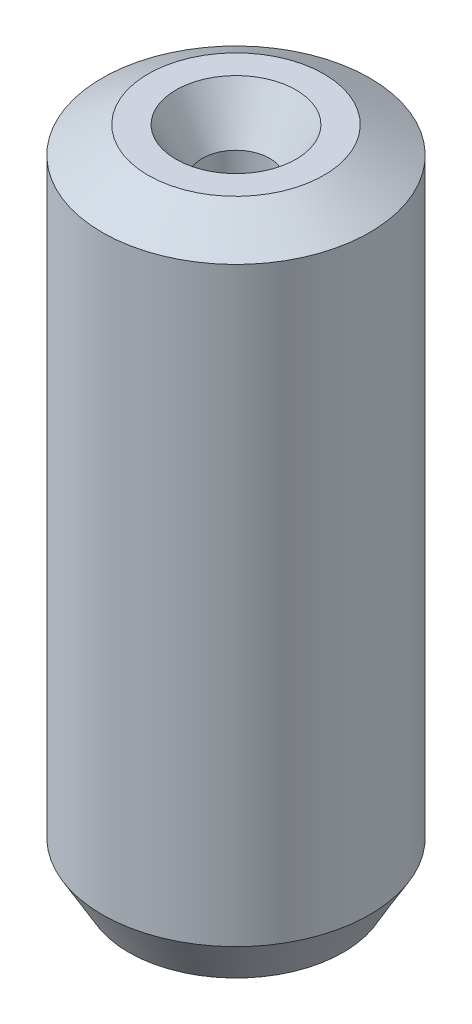
ISO-10303-21;
HEADER;
FILE_DESCRIPTION(('STEP AP214'),'2;1');
FILE_NAME('part.step','',(''),(''),'','','');
FILE_SCHEMA(('AUTOMOTIVE_DESIGN { 1 0 10303 214 1 1 1 1 }'));
ENDSEC;
DATA;
#1=APPLICATION_CONTEXT('core data for automotive mechanical design processes');
#2=APPLICATION_PROTOCOL_DEFINITION('international standard','automotive_design',2000,#1);
#3=PRODUCT_CONTEXT('',#1,'mechanical');
#4=PRODUCT('Part','Part','',(#3));
#5=PRODUCT_RELATED_PRODUCT_CATEGORY('part','',(#4));
#6=PRODUCT_DEFINITION_FORMATION('','',#4);
#7=PRODUCT_DEFINITION_CONTEXT('part definition',#1,'design');
#8=PRODUCT_DEFINITION('design','',#6,#7);
#9=PRODUCT_DEFINITION_SHAPE('','',#8);
#10=(LENGTH_UNIT() NAMED_UNIT(*) SI_UNIT(.MILLI.,.METRE.));
#11=(NAMED_UNIT(*) PLANE_ANGLE_UNIT() SI_UNIT($,.RADIAN.));
#12=(NAMED_UNIT(*) SI_UNIT($,.STERADIAN.) SOLID_ANGLE_UNIT());
#13=UNCERTAINTY_MEASURE_WITH_UNIT(LENGTH_MEASURE(1.E-05),#10,'distance_accuracy_value','');
#14=(GEOMETRIC_REPRESENTATION_CONTEXT(3) GLOBAL_UNCERTAINTY_ASSIGNED_CONTEXT((#13)) GLOBAL_UNIT_ASSIGNED_CONTEXT((#10,
#11,#12)) REPRESENTATION_CONTEXT('',''));
#15=CARTESIAN_POINT('',(0.,0.,0.));
#16=DIRECTION('',(0.,0.,1.));
#17=DIRECTION('',(1.,0.,0.));
#18=AXIS2_PLACEMENT_3D('',#15,#16,#17);
#19=CARTESIAN_POINT('',(0.,24.7867432425928,0.));
#20=DIRECTION('',(0.,-1.,0.));
#21=DIRECTION('',(0.,0.,-1.));
#22=AXIS2_PLACEMENT_3D('',#19,#20,#21);
#23=CYLINDRICAL_SURFACE('',#22,5.);
#24=CARTESIAN_POINT('',(0.,1.71622205691779,0.));
#25=DIRECTION('',(0.,1.,0.));
#26=DIRECTION('',(0.,0.,1.));
#27=AXIS2_PLACEMENT_3D('',#24,#25,#26);
#28=CIRCLE('',#27,5.);
#29=CARTESIAN_POINT('',(0.,1.71622205691779,5.));
#30=VERTEX_POINT('',#29);
#31=EDGE_CURVE('E10',#30,#30,#28,.T.);
#32=ORIENTED_EDGE('',*,*,#31,.T.);
#33=EDGE_LOOP('',(#32));
#34=FACE_BOUND('',#33,.T.);
#35=CARTESIAN_POINT('',(0.,23.7958819760422,0.));
#36=DIRECTION('',(0.,1.,0.));
#37=DIRECTION('',(0.,0.,1.));
#38=AXIS2_PLACEMENT_3D('',#35,#36,#37);
#39=CIRCLE('',#38,5.);
#40=CARTESIAN_POINT('',(0.,23.7958819760422,5.));
#41=VERTEX_POINT('',#40);
#42=EDGE_CURVE('E50',#41,#41,#39,.F.);
#43=ORIENTED_EDGE('',*,*,#42,.T.);
#44=EDGE_LOOP('',(#43));
#45=FACE_BOUND('',#44,.T.);
#46=ADVANCED_FACE('F39',(#34,#45),#23,.T.);
#47=CARTESIAN_POINT('',(0.,24.7867432425928,0.));
#48=DIRECTION('',(0.,1.,0.));
#49=DIRECTION('',(0.,0.,1.));
#50=AXIS2_PLACEMENT_3D('',#47,#48,#49);
#51=PLANE('',#50);
#52=CARTESIAN_POINT('',(0.,24.7867432425928,0.));
#53=DIRECTION('',(0.,1.,0.));
#54=DIRECTION('',(0.,0.,1.));
#55=AXIS2_PLACEMENT_3D('',#52,#53,#54);
#56=CIRCLE('',#55,2.24476600900823);
#57=CARTESIAN_POINT('',(0.,24.7867432425928,2.24476600900822));
#58=VERTEX_POINT('',#57);
#59=EDGE_CURVE('E58',#58,#58,#56,.F.);
#60=ORIENTED_EDGE('',*,*,#59,.T.);
#61=EDGE_LOOP('',(#60));
#62=FACE_BOUND('',#61,.T.);
#63=CARTESIAN_POINT('',(0.,24.7867432425928,0.));
#64=DIRECTION('',(0.,1.,0.));
#65=DIRECTION('',(0.,0.,1.));
#66=AXIS2_PLACEMENT_3D('',#63,#64,#65);
#67=CIRCLE('',#66,3.2837779430822);
#68=CARTESIAN_POINT('',(0.,24.7867432425928,3.2837779430822));
#69=VERTEX_POINT('',#68);
#70=EDGE_CURVE('E61',#69,#69,#67,.T.);
#71=ORIENTED_EDGE('',*,*,#70,.T.);
#72=EDGE_LOOP('',(#71));
#73=FACE_BOUND('',#72,.T.);
#74=ADVANCED_FACE('F88',(#62,#73),#51,.T.);
#75=CARTESIAN_POINT('',(0.,0.,0.));
#76=DIRECTION('',(0.,1.,0.));
#77=DIRECTION('',(0.,0.,1.));
#78=AXIS2_PLACEMENT_3D('',#75,#76,#77);
#79=PLANE('',#78);
#80=CARTESIAN_POINT('',(0.,0.,0.));
#81=DIRECTION('',(0.,1.,0.));
#82=DIRECTION('',(0.,0.,1.));
#83=AXIS2_PLACEMENT_3D('',#80,#81,#82);
#84=CIRCLE('',#83,2.97012679937535);
#85=CARTESIAN_POINT('',(0.,0.,2.97012679937535));
#86=VERTEX_POINT('',#85);
#87=EDGE_CURVE('E51',#86,#86,#84,.T.);
#88=ORIENTED_EDGE('',*,*,#87,.T.);
#89=EDGE_LOOP('',(#88));
#90=FACE_BOUND('',#89,.T.);
#91=CARTESIAN_POINT('',(0.,0.,0.));
#92=DIRECTION('',(0.,1.,0.));
#93=DIRECTION('',(0.,0.,1.));
#94=AXIS2_PLACEMENT_3D('',#91,#92,#93);
#95=CIRCLE('',#94,4.00913873344933);
#96=CARTESIAN_POINT('',(0.,0.,4.00913873344933));
#97=VERTEX_POINT('',#96);
#98=EDGE_CURVE('E54',#97,#97,#95,.F.);
#99=ORIENTED_EDGE('',*,*,#98,.T.);
#100=EDGE_LOOP('',(#99));
#101=FACE_BOUND('',#100,.T.);
#102=ADVANCED_FACE('F83',(#90,#101),#79,.F.);
#103=CARTESIAN_POINT('',(0.,24.7867432425928,0.));
#104=DIRECTION('',(0.,-1.,0.));
#105=DIRECTION('',(0.,0.,-1.));
#106=AXIS2_PLACEMENT_3D('',#103,#104,#105);
#107=CYLINDRICAL_SURFACE('',#106,1.25390474245756);
#108=CARTESIAN_POINT('',(0.,23.070521185675,0.));
#109=DIRECTION('',(0.,1.,0.));
#110=DIRECTION('',(0.,0.,1.));
#111=AXIS2_PLACEMENT_3D('',#108,#109,#110);
#112=CIRCLE('',#111,1.25390474245756);
#113=CARTESIAN_POINT('',(0.,23.070521185675,1.25390474245756));
#114=VERTEX_POINT('',#113);
#115=EDGE_CURVE('E67',#114,#114,#112,.T.);
#116=ORIENTED_EDGE('',*,*,#115,.T.);
#117=EDGE_LOOP('',(#116));
#118=FACE_BOUND('',#117,.T.);
#119=CARTESIAN_POINT('',(0.,0.990861266550666,0.));
#120=DIRECTION('',(0.,1.,0.));
#121=DIRECTION('',(0.,0.,1.));
#122=AXIS2_PLACEMENT_3D('',#119,#120,#121);
#123=CIRCLE('',#122,1.25390474245756);
#124=CARTESIAN_POINT('',(0.,0.990861266550666,1.25390474245756));
#125=VERTEX_POINT('',#124);
#126=EDGE_CURVE('E69',#125,#125,#123,.F.);
#127=ORIENTED_EDGE('',*,*,#126,.T.);
#128=EDGE_LOOP('',(#127));
#129=FACE_BOUND('',#128,.T.);
#130=ADVANCED_FACE('F71',(#118,#129),#107,.F.);
#131=CARTESIAN_POINT('',(0.,23.070521185675,0.));
#132=DIRECTION('',(0.,1.,0.));
#133=DIRECTION('',(0.,0.,1.));
#134=AXIS2_PLACEMENT_3D('',#131,#132,#133);
#135=CONICAL_SURFACE('',#134,1.25390474245756,0.523598775598303);
#136=CARTESIAN_POINT('',(0.,24.7867432425928,2.24476600900822));
#137=CARTESIAN_POINT('',(0.,24.7688659294999,2.23444453748165));
#138=CARTESIAN_POINT('',(0.,24.750988616407,2.22412306595509));
#139=CARTESIAN_POINT('',(0.,24.7152339902213,2.20348012290195));
#140=CARTESIAN_POINT('',(0.,24.6973566771284,2.19315865137538));
#141=CARTESIAN_POINT('',(0.,24.6616020509426,2.17251570832224));
#142=CARTESIAN_POINT('',(0.,24.6437247378497,2.16219423679567));
#143=CARTESIAN_POINT('',(0.,24.6079701116639,2.14155129374253));
#144=CARTESIAN_POINT('',(0.,24.590092798571,2.13122982221596));
#145=CARTESIAN_POINT('',(0.,24.5543381723852,2.11058687916282));
#146=CARTESIAN_POINT('',(0.,24.5364608592923,2.10026540763625));
#147=CARTESIAN_POINT('',(0.,24.5007062331065,2.07962246458311));
#148=CARTESIAN_POINT('',(0.,24.4828289200136,2.06930099305654));
#149=CARTESIAN_POINT('',(0.,24.4470742938279,2.04865805000341));
#150=CARTESIAN_POINT('',(0.,24.429196980735,2.03833657847684));
#151=CARTESIAN_POINT('',(0.,24.3934423545492,2.0176936354237));
#152=CARTESIAN_POINT('',(0.,24.3755650414563,2.00737216389713));
#153=CARTESIAN_POINT('',(0.,24.3398104152705,1.98672922084399));
#154=CARTESIAN_POINT('',(0.,24.3219331021776,1.97640774931742));
#155=CARTESIAN_POINT('',(0.,24.2861784759918,1.95576480626428));
#156=CARTESIAN_POINT('',(0.,24.2683011628989,1.94544333473771));
#157=CARTESIAN_POINT('',(0.,24.2325465367131,1.92480039168457));
#158=CARTESIAN_POINT('',(0.,24.2146692236202,1.914478920158));
#159=CARTESIAN_POINT('',(0.,24.1789145974344,1.89383597710486));
#160=CARTESIAN_POINT('',(0.,24.1610372843416,1.88351450557829));
#161=CARTESIAN_POINT('',(0.,24.1252826581558,1.86287156252516));
#162=CARTESIAN_POINT('',(0.,24.1074053450629,1.85255009099859));
#163=CARTESIAN_POINT('',(0.,24.0716507188771,1.83190714794545));
#164=CARTESIAN_POINT('',(0.,24.0537734057842,1.82158567641888));
#165=CARTESIAN_POINT('',(0.,24.0180187795984,1.80094273336574));
#166=CARTESIAN_POINT('',(0.,24.0001414665055,1.79062126183917));
#167=CARTESIAN_POINT('',(0.,23.9643868403197,1.76997831878603));
#168=CARTESIAN_POINT('',(0.,23.9465095272268,1.75965684725946));
#169=CARTESIAN_POINT('',(0.,23.910754901041,1.73901390420632));
#170=CARTESIAN_POINT('',(0.,23.8928775879482,1.72869243267975));
#171=CARTESIAN_POINT('',(0.,23.8571229617624,1.70804948962661));
#172=CARTESIAN_POINT('',(0.,23.8392456486695,1.69772801810004));
#173=CARTESIAN_POINT('',(0.,23.8034910224837,1.67708507504691));
#174=CARTESIAN_POINT('',(0.,23.7856137093908,1.66676360352034));
#175=CARTESIAN_POINT('',(0.,23.749859083205,1.6461206604672));
#176=CARTESIAN_POINT('',(0.,23.7319817701121,1.63579918894063));
#177=CARTESIAN_POINT('',(0.,23.6962271439263,1.61515624588749));
#178=CARTESIAN_POINT('',(0.,23.6783498308334,1.60483477436092));
#179=CARTESIAN_POINT('',(0.,23.6425952046476,1.58419183130778));
#180=CARTESIAN_POINT('',(0.,23.6247178915547,1.57387035978121));
#181=CARTESIAN_POINT('',(0.,23.588963265369,1.55322741672807));
#182=CARTESIAN_POINT('',(0.,23.5710859522761,1.5429059452015));
#183=CARTESIAN_POINT('',(0.,23.5353313260903,1.52226300214836));
#184=CARTESIAN_POINT('',(0.,23.5174540129974,1.51194153062179));
#185=CARTESIAN_POINT('',(0.,23.4816993868116,1.49129858756866));
#186=CARTESIAN_POINT('',(0.,23.4638220737187,1.48097711604209));
#187=CARTESIAN_POINT('',(0.,23.4280674475329,1.46033417298895));
#188=CARTESIAN_POINT('',(0.,23.41019013444,1.45001270146238));
#189=CARTESIAN_POINT('',(0.,23.3744355082542,1.42936975840924));
#190=CARTESIAN_POINT('',(0.,23.3565581951613,1.41904828688267));
#191=CARTESIAN_POINT('',(0.,23.3208035689756,1.39840534382953));
#192=CARTESIAN_POINT('',(0.,23.3029262558827,1.38808387230296));
#193=CARTESIAN_POINT('',(0.,23.2671716296969,1.36744092924982));
#194=CARTESIAN_POINT('',(0.,23.249294316604,1.35711945772325));
#195=CARTESIAN_POINT('',(0.,23.2135396904182,1.33647651467011));
#196=CARTESIAN_POINT('',(0.,23.1956623773253,1.32615504314354));
#197=CARTESIAN_POINT('',(0.,23.1599077511395,1.30551210009041));
#198=CARTESIAN_POINT('',(0.,23.1420304380466,1.29519062856384));
#199=CARTESIAN_POINT('',(0.,23.1062758118608,1.2745476855107));
#200=CARTESIAN_POINT('',(0.,23.0883984987679,1.26422621398413));
#201=CARTESIAN_POINT('',(0.,23.070521185675,1.25390474245756));
#202=B_SPLINE_CURVE_WITH_KNOTS('',3,(#136,#137,#138,#139,#140,#141,#142,#143,#144,#145,#146,
#147,#148,#149,#150,#151,#152,#153,#154,#155,#156,#157,#158,#159,#160,#161,#162,#163,#164,#165,
#166,#167,#168,#169,#170,#171,#172,#173,#174,#175,#176,#177,#178,#179,#180,#181,#182,#183,#184,
#185,#186,#187,#188,#189,#190,#191,#192,#193,#194,#195,#196,#197,#198,#199,#200,#201),
.UNSPECIFIED.,.F.,.F.,(4,2,2,2,2,2,2,2,2,2,2,2,2,2,2,2,2,2,2,2,2,2,2,2,2,2,2,2,2,2,2,2,4),(0.,
0.0619288291594134,0.12385765831883,0.185786487478246,0.247715316637663,0.309644145797079,
0.371572974956495,0.433501804115912,0.495430633275328,0.557359462434745,0.619288291594161,
0.681217120753578,0.743145949912994,0.80507477907241,0.867003608231827,0.928932437391243,
0.99086126655066,1.05279009571007,1.11471892486949,1.17664775402891,1.23857658318832,
1.30050541234774,1.36243424150716,1.42436307066657,1.48629189982599,1.5482207289854,
1.61014955814482,1.67207838730424,1.73400721646365,1.79593604562307,1.85786487478249,
1.9197937039419,1.98172253310132),.UNSPECIFIED.);
#203=EDGE_CURVE('BSEAM77',#58,#114,#202,.T.);
#204=ORIENTED_EDGE('',*,*,#59,.F.);
#205=ORIENTED_EDGE('',*,*,#115,.F.);
#206=ORIENTED_EDGE('',*,*,#203,.T.);
#207=ORIENTED_EDGE('',*,*,#203,.F.);
#208=EDGE_LOOP('',(#204,#206,#205,#207));
#209=FACE_BOUND('',#208,.T.);
#210=ADVANCED_FACE('F77',(#209),#135,.F.);
#211=CARTESIAN_POINT('',(0.,0.,0.));
#212=DIRECTION('',(0.,-1.,0.));
#213=DIRECTION('',(0.,0.,-1.));
#214=AXIS2_PLACEMENT_3D('',#211,#212,#213);
#215=CONICAL_SURFACE('',#214,2.97012679937535,1.04719755119659);
#216=ORIENTED_EDGE('',*,*,#126,.F.);
#217=EDGE_LOOP('',(#216));
#218=FACE_BOUND('',#217,.T.);
#219=ORIENTED_EDGE('',*,*,#87,.F.);
#220=EDGE_LOOP('',(#219));
#221=FACE_BOUND('',#220,.T.);
#222=ADVANCED_FACE('F73',(#218,#221),#215,.F.);
#223=CARTESIAN_POINT('',(0.,1.71622205691779,0.));
#224=DIRECTION('',(0.,1.,0.));
#225=DIRECTION('',(0.,0.,1.));
#226=AXIS2_PLACEMENT_3D('',#223,#224,#225);
#227=CONICAL_SURFACE('',#226,5.,0.523598775598303);
#228=ORIENTED_EDGE('',*,*,#98,.F.);
#229=EDGE_LOOP('',(#228));
#230=FACE_BOUND('',#229,.T.);
#231=ORIENTED_EDGE('',*,*,#31,.F.);
#232=EDGE_LOOP('',(#231));
#233=FACE_BOUND('',#232,.T.);
#234=ADVANCED_FACE('F76',(#230,#233),#227,.T.);
#235=CARTESIAN_POINT('',(0.,24.7867432425928,0.));
#236=DIRECTION('',(0.,-1.,0.));
#237=DIRECTION('',(0.,0.,-1.));
#238=AXIS2_PLACEMENT_3D('',#235,#236,#237);
#239=CONICAL_SURFACE('',#238,3.2837779430822,1.04719755119659);
#240=ORIENTED_EDGE('',*,*,#42,.F.);
#241=EDGE_LOOP('',(#240));
#242=FACE_BOUND('',#241,.T.);
#243=ORIENTED_EDGE('',*,*,#70,.F.);
#244=EDGE_LOOP('',(#243));
#245=FACE_BOUND('',#244,.T.);
#246=ADVANCED_FACE('F45',(#242,#245),#239,.T.);
#247=CLOSED_SHELL('',(#46,#74,#102,#130,#210,#222,#234,#246));
#248=MANIFOLD_SOLID_BREP('B2',#247);
#249=ADVANCED_BREP_SHAPE_REPRESENTATION('',(#18,#248),#14);
#250=SHAPE_DEFINITION_REPRESENTATION(#9,#249);
ENDSEC;
END-ISO-10303-21;
